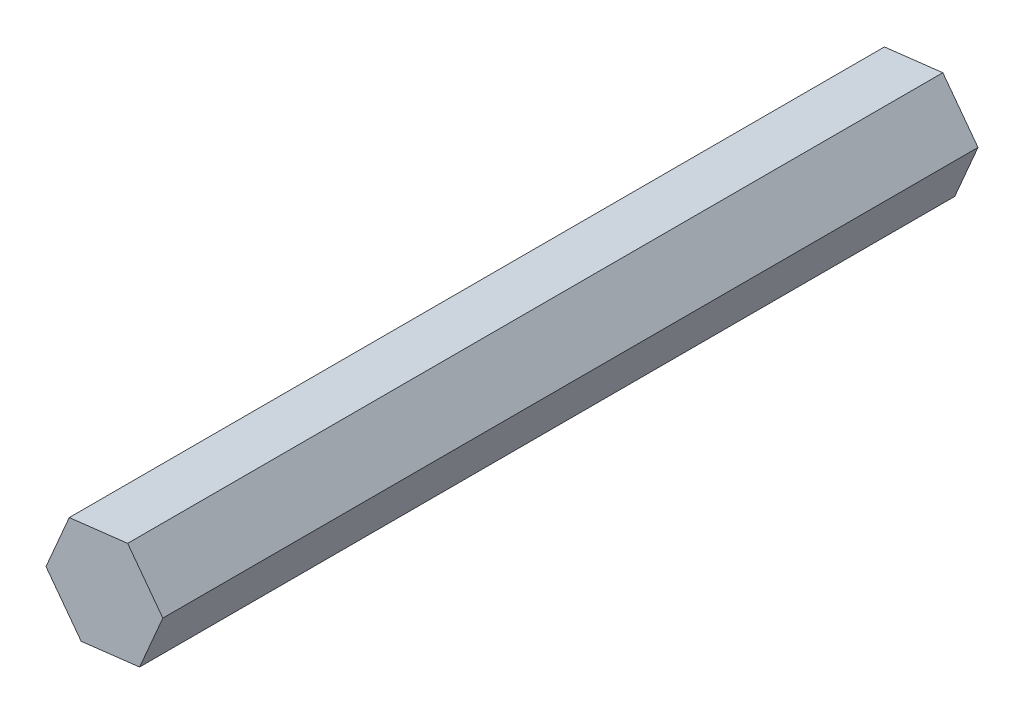
ISO-10303-21;
HEADER;
FILE_DESCRIPTION(('STEP AP214'),'2;1');
FILE_NAME('part.step','',(''),(''),'','','');
FILE_SCHEMA(('AUTOMOTIVE_DESIGN { 1 0 10303 214 1 1 1 1 }'));
ENDSEC;
DATA;
#1=APPLICATION_CONTEXT('core data for automotive mechanical design processes');
#2=APPLICATION_PROTOCOL_DEFINITION('international standard','automotive_design',2000,#1);
#3=PRODUCT_CONTEXT('',#1,'mechanical');
#4=PRODUCT('Part','Part','',(#3));
#5=PRODUCT_RELATED_PRODUCT_CATEGORY('part','',(#4));
#6=PRODUCT_DEFINITION_FORMATION('','',#4);
#7=PRODUCT_DEFINITION_CONTEXT('part definition',#1,'design');
#8=PRODUCT_DEFINITION('design','',#6,#7);
#9=PRODUCT_DEFINITION_SHAPE('','',#8);
#10=(LENGTH_UNIT() NAMED_UNIT(*) SI_UNIT(.MILLI.,.METRE.));
#11=(NAMED_UNIT(*) PLANE_ANGLE_UNIT() SI_UNIT($,.RADIAN.));
#12=(NAMED_UNIT(*) SI_UNIT($,.STERADIAN.) SOLID_ANGLE_UNIT());
#13=UNCERTAINTY_MEASURE_WITH_UNIT(LENGTH_MEASURE(1.E-05),#10,'distance_accuracy_value','');
#14=(GEOMETRIC_REPRESENTATION_CONTEXT(3) GLOBAL_UNCERTAINTY_ASSIGNED_CONTEXT((#13)) GLOBAL_UNIT_ASSIGNED_CONTEXT((#10,
#11,#12)) REPRESENTATION_CONTEXT('',''));
#15=CARTESIAN_POINT('',(0.,0.,0.));
#16=DIRECTION('',(0.,0.,1.));
#17=DIRECTION('',(1.,0.,0.));
#18=AXIS2_PLACEMENT_3D('',#15,#16,#17);
#19=CARTESIAN_POINT('',(-4.38410904308102,5.8773226244361,101.6));
#20=DIRECTION('',(0.918588524694506,-0.395215286014559,0.));
#21=DIRECTION('',(0.395215286014559,0.918588524694506,0.));
#22=AXIS2_PLACEMENT_3D('',#19,#20,#21);
#23=PLANE('',#22);
#24=DIRECTION('',(-0.395215286014559,-0.918588524694506,0.));
#25=VECTOR('',#24,1.);
#26=CARTESIAN_POINT('',(-4.38410904308102,5.8773226244361,0.));
#27=LINE('',#26,#25);
#28=CARTESIAN_POINT('',(-4.38410904308102,5.8773226244361,0.));
#29=VERTEX_POINT('',#28);
#30=CARTESIAN_POINT('',(-7.2819652205392,-0.858088492051198,0.));
#31=VERTEX_POINT('',#30);
#32=EDGE_CURVE('E128',#29,#31,#27,.T.);
#33=ORIENTED_EDGE('',*,*,#32,.T.);
#34=DIRECTION('',(0.,0.,-1.));
#35=VECTOR('',#34,1.);
#36=CARTESIAN_POINT('',(-7.2819652205392,-0.858088492051198,101.6));
#37=LINE('',#36,#35);
#38=CARTESIAN_POINT('',(-7.2819652205392,-0.858088492051198,101.6));
#39=VERTEX_POINT('',#38);
#40=EDGE_CURVE('E11',#39,#31,#37,.T.);
#41=ORIENTED_EDGE('',*,*,#40,.F.);
#42=DIRECTION('',(-0.395215286014559,-0.918588524694506,0.));
#43=VECTOR('',#42,1.);
#44=CARTESIAN_POINT('',(-4.38410904308102,5.8773226244361,101.6));
#45=LINE('',#44,#43);
#46=CARTESIAN_POINT('',(-4.38410904308102,5.8773226244361,101.6));
#47=VERTEX_POINT('',#46);
#48=EDGE_CURVE('E144',#47,#39,#45,.T.);
#49=ORIENTED_EDGE('',*,*,#48,.F.);
#50=DIRECTION('',(0.,0.,-1.));
#51=VECTOR('',#50,1.);
#52=CARTESIAN_POINT('',(-4.38410904308102,5.8773226244361,101.6));
#53=LINE('',#52,#51);
#54=EDGE_CURVE('E124',#47,#29,#53,.T.);
#55=ORIENTED_EDGE('',*,*,#54,.T.);
#56=EDGE_LOOP('',(#33,#41,#49,#55));
#57=FACE_BOUND('',#56,.T.);
#58=ADVANCED_FACE('F39',(#57),#23,.F.);
#59=CARTESIAN_POINT('',(-7.2819652205392,-0.858088492051198,101.6));
#60=DIRECTION('',(0.801560739999795,0.597913355003032,0.));
#61=DIRECTION('',(-0.597913355003032,0.801560739999795,0.));
#62=AXIS2_PLACEMENT_3D('',#59,#60,#61);
#63=PLANE('',#62);
#64=DIRECTION('',(0.597913355003032,-0.801560739999795,0.));
#65=VECTOR('',#64,1.);
#66=CARTESIAN_POINT('',(-7.2819652205392,-0.858088492051198,0.));
#67=LINE('',#66,#65);
#68=CARTESIAN_POINT('',(-2.89785617745818,-6.7354111164873,0.));
#69=VERTEX_POINT('',#68);
#70=EDGE_CURVE('E132',#31,#69,#67,.T.);
#71=ORIENTED_EDGE('',*,*,#70,.T.);
#72=DIRECTION('',(0.,0.,-1.));
#73=VECTOR('',#72,1.);
#74=CARTESIAN_POINT('',(-2.89785617745818,-6.7354111164873,101.6));
#75=LINE('',#74,#73);
#76=CARTESIAN_POINT('',(-2.89785617745818,-6.7354111164873,101.6));
#77=VERTEX_POINT('',#76);
#78=EDGE_CURVE('E48',#77,#69,#75,.T.);
#79=ORIENTED_EDGE('',*,*,#78,.F.);
#80=DIRECTION('',(0.597913355003032,-0.801560739999795,0.));
#81=VECTOR('',#80,1.);
#82=CARTESIAN_POINT('',(-7.2819652205392,-0.858088492051198,101.6));
#83=LINE('',#82,#81);
#84=EDGE_CURVE('E93',#39,#77,#83,.T.);
#85=ORIENTED_EDGE('',*,*,#84,.F.);
#86=ORIENTED_EDGE('',*,*,#40,.T.);
#87=EDGE_LOOP('',(#71,#79,#85,#86));
#88=FACE_BOUND('',#87,.T.);
#89=ADVANCED_FACE('F172',(#88),#63,.F.);
#90=CARTESIAN_POINT('',(-2.89785617745818,-6.7354111164873,101.6));
#91=DIRECTION('',(-0.117027784694712,0.993128641017592,0.));
#92=DIRECTION('',(-0.993128641017592,-0.117027784694712,0.));
#93=AXIS2_PLACEMENT_3D('',#90,#91,#92);
#94=PLANE('',#93);
#95=DIRECTION('',(0.993128641017591,0.117027784694712,0.));
#96=VECTOR('',#95,1.);
#97=CARTESIAN_POINT('',(-2.89785617745818,-6.7354111164873,0.));
#98=LINE('',#97,#96);
#99=CARTESIAN_POINT('',(4.38410904308102,-5.8773226244361,0.));
#100=VERTEX_POINT('',#99);
#101=EDGE_CURVE('E135',#69,#100,#98,.T.);
#102=ORIENTED_EDGE('',*,*,#101,.T.);
#103=DIRECTION('',(0.,0.,-1.));
#104=VECTOR('',#103,1.);
#105=CARTESIAN_POINT('',(4.38410904308102,-5.8773226244361,101.6));
#106=LINE('',#105,#104);
#107=CARTESIAN_POINT('',(4.38410904308102,-5.8773226244361,101.6));
#108=VERTEX_POINT('',#107);
#109=EDGE_CURVE('E117',#108,#100,#106,.T.);
#110=ORIENTED_EDGE('',*,*,#109,.F.);
#111=DIRECTION('',(0.993128641017591,0.117027784694712,0.));
#112=VECTOR('',#111,1.);
#113=CARTESIAN_POINT('',(-2.89785617745818,-6.7354111164873,101.6));
#114=LINE('',#113,#112);
#115=EDGE_CURVE('E106',#77,#108,#114,.T.);
#116=ORIENTED_EDGE('',*,*,#115,.F.);
#117=ORIENTED_EDGE('',*,*,#78,.T.);
#118=EDGE_LOOP('',(#102,#110,#116,#117));
#119=FACE_BOUND('',#118,.T.);
#120=ADVANCED_FACE('F154',(#119),#94,.F.);
#121=CARTESIAN_POINT('',(4.38410904308102,-5.8773226244361,101.6));
#122=DIRECTION('',(-0.918588524694507,0.395215286014559,0.));
#123=DIRECTION('',(-0.395215286014559,-0.918588524694507,0.));
#124=AXIS2_PLACEMENT_3D('',#121,#122,#123);
#125=PLANE('',#124);
#126=DIRECTION('',(0.395215286014559,0.918588524694507,0.));
#127=VECTOR('',#126,1.);
#128=CARTESIAN_POINT('',(4.38410904308102,-5.8773226244361,0.));
#129=LINE('',#128,#127);
#130=CARTESIAN_POINT('',(7.2819652205392,0.8580884920512,0.));
#131=VERTEX_POINT('',#130);
#132=EDGE_CURVE('E115',#100,#131,#129,.T.);
#133=ORIENTED_EDGE('',*,*,#132,.T.);
#134=DIRECTION('',(0.,0.,-1.));
#135=VECTOR('',#134,1.);
#136=CARTESIAN_POINT('',(7.2819652205392,0.8580884920512,101.6));
#137=LINE('',#136,#135);
#138=CARTESIAN_POINT('',(7.2819652205392,0.8580884920512,101.6));
#139=VERTEX_POINT('',#138);
#140=EDGE_CURVE('E112',#139,#131,#137,.T.);
#141=ORIENTED_EDGE('',*,*,#140,.F.);
#142=DIRECTION('',(0.395215286014559,0.918588524694507,0.));
#143=VECTOR('',#142,1.);
#144=CARTESIAN_POINT('',(4.38410904308102,-5.8773226244361,101.6));
#145=LINE('',#144,#143);
#146=EDGE_CURVE('E100',#108,#139,#145,.T.);
#147=ORIENTED_EDGE('',*,*,#146,.F.);
#148=ORIENTED_EDGE('',*,*,#109,.T.);
#149=EDGE_LOOP('',(#133,#141,#147,#148));
#150=FACE_BOUND('',#149,.T.);
#151=ADVANCED_FACE('F113',(#150),#125,.F.);
#152=CARTESIAN_POINT('',(7.2819652205392,0.8580884920512,101.6));
#153=DIRECTION('',(-0.801560739999795,-0.597913355003031,0.));
#154=DIRECTION('',(0.597913355003032,-0.801560739999795,0.));
#155=AXIS2_PLACEMENT_3D('',#152,#153,#154);
#156=PLANE('',#155);
#157=DIRECTION('',(-0.597913355003032,0.801560739999795,0.));
#158=VECTOR('',#157,1.);
#159=CARTESIAN_POINT('',(7.2819652205392,0.8580884920512,0.));
#160=LINE('',#159,#158);
#161=CARTESIAN_POINT('',(2.89785617745819,6.7354111164873,0.));
#162=VERTEX_POINT('',#161);
#163=EDGE_CURVE('E79',#131,#162,#160,.T.);
#164=ORIENTED_EDGE('',*,*,#163,.T.);
#165=DIRECTION('',(0.,0.,-1.));
#166=VECTOR('',#165,1.);
#167=CARTESIAN_POINT('',(2.89785617745819,6.7354111164873,101.6));
#168=LINE('',#167,#166);
#169=CARTESIAN_POINT('',(2.89785617745819,6.7354111164873,101.6));
#170=VERTEX_POINT('',#169);
#171=EDGE_CURVE('E118',#170,#162,#168,.T.);
#172=ORIENTED_EDGE('',*,*,#171,.F.);
#173=DIRECTION('',(-0.597913355003032,0.801560739999795,0.));
#174=VECTOR('',#173,1.);
#175=CARTESIAN_POINT('',(7.2819652205392,0.8580884920512,101.6));
#176=LINE('',#175,#174);
#177=EDGE_CURVE('E104',#139,#170,#176,.T.);
#178=ORIENTED_EDGE('',*,*,#177,.F.);
#179=ORIENTED_EDGE('',*,*,#140,.T.);
#180=EDGE_LOOP('',(#164,#172,#178,#179));
#181=FACE_BOUND('',#180,.T.);
#182=ADVANCED_FACE('F120',(#181),#156,.F.);
#183=CARTESIAN_POINT('',(2.89785617745819,6.7354111164873,101.6));
#184=DIRECTION('',(0.117027784694712,-0.993128641017592,0.));
#185=DIRECTION('',(0.993128641017592,0.117027784694712,0.));
#186=AXIS2_PLACEMENT_3D('',#183,#184,#185);
#187=PLANE('',#186);
#188=DIRECTION('',(-0.993128641017591,-0.117027784694712,0.));
#189=VECTOR('',#188,1.);
#190=CARTESIAN_POINT('',(2.89785617745819,6.7354111164873,0.));
#191=LINE('',#190,#189);
#192=EDGE_CURVE('E85',#162,#29,#191,.T.);
#193=ORIENTED_EDGE('',*,*,#192,.T.);
#194=ORIENTED_EDGE('',*,*,#54,.F.);
#195=DIRECTION('',(-0.993128641017591,-0.117027784694712,0.));
#196=VECTOR('',#195,1.);
#197=CARTESIAN_POINT('',(2.89785617745819,6.7354111164873,101.6));
#198=LINE('',#197,#196);
#199=EDGE_CURVE('E56',#170,#47,#198,.T.);
#200=ORIENTED_EDGE('',*,*,#199,.F.);
#201=ORIENTED_EDGE('',*,*,#171,.T.);
#202=EDGE_LOOP('',(#193,#194,#200,#201));
#203=FACE_BOUND('',#202,.T.);
#204=ADVANCED_FACE('F161',(#203),#187,.F.);
#205=CARTESIAN_POINT('',(0.,0.,101.6));
#206=DIRECTION('',(0.,0.,1.));
#207=DIRECTION('',(1.,0.,0.));
#208=AXIS2_PLACEMENT_3D('',#205,#206,#207);
#209=PLANE('',#208);
#210=ORIENTED_EDGE('',*,*,#48,.T.);
#211=ORIENTED_EDGE('',*,*,#84,.T.);
#212=ORIENTED_EDGE('',*,*,#115,.T.);
#213=ORIENTED_EDGE('',*,*,#146,.T.);
#214=ORIENTED_EDGE('',*,*,#177,.T.);
#215=ORIENTED_EDGE('',*,*,#199,.T.);
#216=EDGE_LOOP('',(#210,#211,#212,#213,#214,#215));
#217=FACE_BOUND('',#216,.T.);
#218=ADVANCED_FACE('F102',(#217),#209,.T.);
#219=CARTESIAN_POINT('',(0.,0.,0.));
#220=DIRECTION('',(0.,0.,1.));
#221=DIRECTION('',(1.,0.,0.));
#222=AXIS2_PLACEMENT_3D('',#219,#220,#221);
#223=PLANE('',#222);
#224=ORIENTED_EDGE('',*,*,#32,.F.);
#225=ORIENTED_EDGE('',*,*,#192,.F.);
#226=ORIENTED_EDGE('',*,*,#163,.F.);
#227=ORIENTED_EDGE('',*,*,#132,.F.);
#228=ORIENTED_EDGE('',*,*,#101,.F.);
#229=ORIENTED_EDGE('',*,*,#70,.F.);
#230=EDGE_LOOP('',(#224,#225,#226,#227,#228,#229));
#231=FACE_BOUND('',#230,.T.);
#232=ADVANCED_FACE('F157',(#231),#223,.F.);
#233=CLOSED_SHELL('',(#58,#89,#120,#151,#182,#204,#218,#232));
#234=MANIFOLD_SOLID_BREP('B2',#233);
#235=ADVANCED_BREP_SHAPE_REPRESENTATION('',(#18,#234),#14);
#236=SHAPE_DEFINITION_REPRESENTATION(#9,#235);
ENDSEC;
END-ISO-10303-21;
